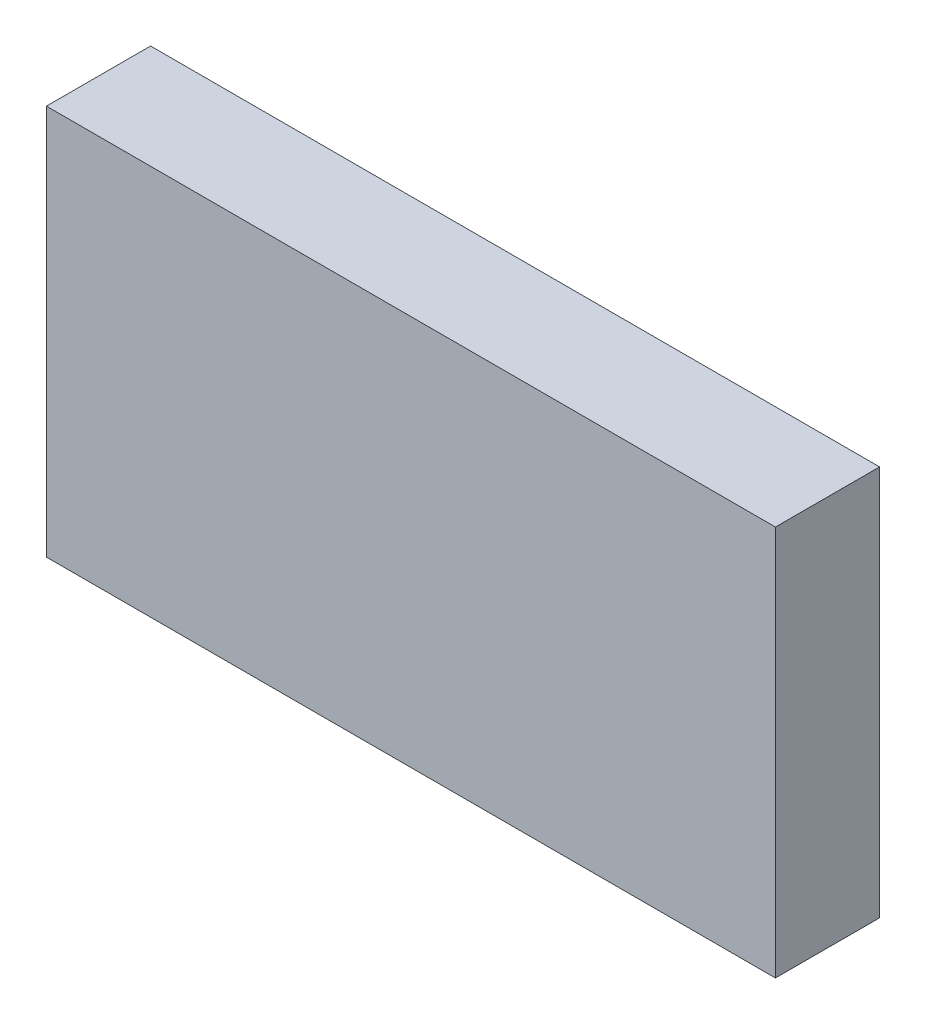
ISO-10303-21;
HEADER;
FILE_DESCRIPTION(('STEP AP214'),'2;1');
FILE_NAME('part.step','',(''),(''),'','','');
FILE_SCHEMA(('AUTOMOTIVE_DESIGN { 1 0 10303 214 1 1 1 1 }'));
ENDSEC;
DATA;
#1=APPLICATION_CONTEXT('core data for automotive mechanical design processes');
#2=APPLICATION_PROTOCOL_DEFINITION('international standard','automotive_design',2000,#1);
#3=PRODUCT_CONTEXT('',#1,'mechanical');
#4=PRODUCT('Part','Part','',(#3));
#5=PRODUCT_RELATED_PRODUCT_CATEGORY('part','',(#4));
#6=PRODUCT_DEFINITION_FORMATION('','',#4);
#7=PRODUCT_DEFINITION_CONTEXT('part definition',#1,'design');
#8=PRODUCT_DEFINITION('design','',#6,#7);
#9=PRODUCT_DEFINITION_SHAPE('','',#8);
#10=(LENGTH_UNIT() NAMED_UNIT(*) SI_UNIT(.MILLI.,.METRE.));
#11=(NAMED_UNIT(*) PLANE_ANGLE_UNIT() SI_UNIT($,.RADIAN.));
#12=(NAMED_UNIT(*) SI_UNIT($,.STERADIAN.) SOLID_ANGLE_UNIT());
#13=UNCERTAINTY_MEASURE_WITH_UNIT(LENGTH_MEASURE(1.E-05),#10,'distance_accuracy_value','');
#14=(GEOMETRIC_REPRESENTATION_CONTEXT(3) GLOBAL_UNCERTAINTY_ASSIGNED_CONTEXT((#13)) GLOBAL_UNIT_ASSIGNED_CONTEXT((#10,
#11,#12)) REPRESENTATION_CONTEXT('',''));
#15=CARTESIAN_POINT('',(0.,0.,0.));
#16=DIRECTION('',(0.,0.,1.));
#17=DIRECTION('',(1.,0.,0.));
#18=AXIS2_PLACEMENT_3D('',#15,#16,#17);
#19=CARTESIAN_POINT('',(-0.591343297244659,-0.649602719280402,0.0826433070866142));
#20=DIRECTION('',(0.,0.,-1.));
#21=DIRECTION('',(0.,1.,0.));
#22=AXIS2_PLACEMENT_3D('',#19,#20,#21);
#23=PLANE('',#22);
#24=DIRECTION('',(0.,1.,0.));
#25=VECTOR('',#24,1.);
#26=CARTESIAN_POINT('',(-0.587815738189541,-0.649602719280402,0.0826433070866142));
#27=LINE('',#26,#25);
#28=CARTESIAN_POINT('',(-0.587815738189541,-0.609917679910324,0.0826433070866142));
#29=VERTEX_POINT('',#28);
#30=CARTESIAN_POINT('',(-0.587815738189541,-0.647712955500875,0.0826433070866142));
#31=VERTEX_POINT('',#30);
#32=EDGE_CURVE('E71',#29,#31,#27,.F.);
#33=ORIENTED_EDGE('',*,*,#32,.T.);
#34=DIRECTION('',(1.,0.,0.));
#35=VECTOR('',#34,1.);
#36=CARTESIAN_POINT('',(-0.513736998032061,-0.647712955500875,0.0826433070866142));
#37=LINE('',#36,#35);
#38=CARTESIAN_POINT('',(-0.517264557087179,-0.647712955500875,0.0826433070866142));
#39=VERTEX_POINT('',#38);
#40=EDGE_CURVE('E54',#39,#31,#37,.F.);
#41=ORIENTED_EDGE('',*,*,#40,.F.);
#42=DIRECTION('',(0.,1.,0.));
#43=VECTOR('',#42,1.);
#44=CARTESIAN_POINT('',(-0.517264557087179,-0.649602719280402,0.0826433070866142));
#45=LINE('',#44,#43);
#46=CARTESIAN_POINT('',(-0.517264557087179,-0.609917679910324,0.0826433070866142));
#47=VERTEX_POINT('',#46);
#48=EDGE_CURVE('E20',#47,#39,#45,.F.);
#49=ORIENTED_EDGE('',*,*,#48,.F.);
#50=DIRECTION('',(1.,0.,0.));
#51=VECTOR('',#50,1.);
#52=CARTESIAN_POINT('',(-0.513736998032061,-0.609917679910324,0.0826433070866142));
#53=LINE('',#52,#51);
#54=EDGE_CURVE('E81',#29,#47,#53,.T.);
#55=ORIENTED_EDGE('',*,*,#54,.F.);
#56=EDGE_LOOP('',(#33,#41,#49,#55));
#57=FACE_BOUND('',#56,.T.);
#58=ADVANCED_FACE('F17',(#57),#23,.F.);
#59=CARTESIAN_POINT('',(-0.517264557087179,-0.649602719280402,0.0720606299212598));
#60=DIRECTION('',(-1.,0.,0.));
#61=DIRECTION('',(0.,0.,1.));
#62=AXIS2_PLACEMENT_3D('',#59,#60,#61);
#63=PLANE('',#62);
#64=DIRECTION('',(0.,0.,-1.));
#65=VECTOR('',#64,1.);
#66=CARTESIAN_POINT('',(-0.517264557087179,-0.609917679910324,0.0831472440944882));
#67=LINE('',#66,#65);
#68=CARTESIAN_POINT('',(-0.517264557087179,-0.609917679910324,0.0725645669291339));
#69=VERTEX_POINT('',#68);
#70=EDGE_CURVE('E64',#47,#69,#67,.T.);
#71=ORIENTED_EDGE('',*,*,#70,.F.);
#72=ORIENTED_EDGE('',*,*,#48,.T.);
#73=DIRECTION('',(0.,0.,1.));
#74=VECTOR('',#73,1.);
#75=CARTESIAN_POINT('',(-0.517264557087179,-0.647712955500875,0.0720606299212598));
#76=LINE('',#75,#74);
#77=CARTESIAN_POINT('',(-0.517264557087179,-0.647712955500875,0.0725645669291339));
#78=VERTEX_POINT('',#77);
#79=EDGE_CURVE('E62',#78,#39,#76,.T.);
#80=ORIENTED_EDGE('',*,*,#79,.F.);
#81=DIRECTION('',(0.,-1.,0.));
#82=VECTOR('',#81,1.);
#83=CARTESIAN_POINT('',(-0.517264557087179,-0.649602719280402,0.0725645669291339));
#84=LINE('',#83,#82);
#85=EDGE_CURVE('E83',#69,#78,#84,.T.);
#86=ORIENTED_EDGE('',*,*,#85,.F.);
#87=EDGE_LOOP('',(#71,#72,#80,#86));
#88=FACE_BOUND('',#87,.T.);
#89=ADVANCED_FACE('F60',(#88),#63,.F.);
#90=CARTESIAN_POINT('',(-0.513736998032061,-0.647712955500875,0.0720606299212598));
#91=DIRECTION('',(0.,1.,0.));
#92=DIRECTION('',(0.,0.,1.));
#93=AXIS2_PLACEMENT_3D('',#90,#91,#92);
#94=PLANE('',#93);
#95=DIRECTION('',(0.,0.,1.));
#96=VECTOR('',#95,1.);
#97=CARTESIAN_POINT('',(-0.587815738189541,-0.647712955500875,0.0720606299212598));
#98=LINE('',#97,#96);
#99=CARTESIAN_POINT('',(-0.587815738189541,-0.647712955500875,0.0725645669291339));
#100=VERTEX_POINT('',#99);
#101=EDGE_CURVE('E73',#31,#100,#98,.F.);
#102=ORIENTED_EDGE('',*,*,#101,.T.);
#103=DIRECTION('',(1.,0.,0.));
#104=VECTOR('',#103,1.);
#105=CARTESIAN_POINT('',(-0.513736998032061,-0.647712955500875,0.0725645669291339));
#106=LINE('',#105,#104);
#107=EDGE_CURVE('E69',#78,#100,#106,.F.);
#108=ORIENTED_EDGE('',*,*,#107,.F.);
#109=ORIENTED_EDGE('',*,*,#79,.T.);
#110=ORIENTED_EDGE('',*,*,#40,.T.);
#111=EDGE_LOOP('',(#102,#108,#109,#110));
#112=FACE_BOUND('',#111,.T.);
#113=ADVANCED_FACE('F68',(#112),#94,.F.);
#114=CARTESIAN_POINT('',(-0.587815738189541,-0.649602719280402,0.0720606299212598));
#115=DIRECTION('',(-1.,0.,0.));
#116=DIRECTION('',(0.,0.,1.));
#117=AXIS2_PLACEMENT_3D('',#114,#115,#116);
#118=PLANE('',#117);
#119=ORIENTED_EDGE('',*,*,#32,.F.);
#120=DIRECTION('',(0.,0.,-1.));
#121=VECTOR('',#120,1.);
#122=CARTESIAN_POINT('',(-0.587815738189541,-0.609917679910324,0.0831472440944882));
#123=LINE('',#122,#121);
#124=CARTESIAN_POINT('',(-0.587815738189541,-0.609917679910324,0.0725645669291339));
#125=VERTEX_POINT('',#124);
#126=EDGE_CURVE('E78',#125,#29,#123,.F.);
#127=ORIENTED_EDGE('',*,*,#126,.F.);
#128=DIRECTION('',(0.,-1.,0.));
#129=VECTOR('',#128,1.);
#130=CARTESIAN_POINT('',(-0.587815738189541,-0.649602719280402,0.0725645669291339));
#131=LINE('',#130,#129);
#132=EDGE_CURVE('E26',#100,#125,#131,.F.);
#133=ORIENTED_EDGE('',*,*,#132,.F.);
#134=ORIENTED_EDGE('',*,*,#101,.F.);
#135=EDGE_LOOP('',(#119,#127,#133,#134));
#136=FACE_BOUND('',#135,.T.);
#137=ADVANCED_FACE('F88',(#136),#118,.T.);
#138=CARTESIAN_POINT('',(-0.513736998032061,-0.609917679910324,0.0831472440944882));
#139=DIRECTION('',(0.,-1.,0.));
#140=DIRECTION('',(0.,0.,-1.));
#141=AXIS2_PLACEMENT_3D('',#138,#139,#140);
#142=PLANE('',#141);
#143=ORIENTED_EDGE('',*,*,#126,.T.);
#144=ORIENTED_EDGE('',*,*,#54,.T.);
#145=ORIENTED_EDGE('',*,*,#70,.T.);
#146=DIRECTION('',(1.,0.,0.));
#147=VECTOR('',#146,1.);
#148=CARTESIAN_POINT('',(-0.513736998032061,-0.609917679910324,0.0725645669291339));
#149=LINE('',#148,#147);
#150=EDGE_CURVE('E11',#125,#69,#149,.T.);
#151=ORIENTED_EDGE('',*,*,#150,.F.);
#152=EDGE_LOOP('',(#143,#144,#145,#151));
#153=FACE_BOUND('',#152,.T.);
#154=ADVANCED_FACE('F91',(#153),#142,.F.);
#155=CARTESIAN_POINT('',(-0.513736998032061,-0.649602719280402,0.0725645669291339));
#156=DIRECTION('',(0.,0.,1.));
#157=DIRECTION('',(0.,-1.,0.));
#158=AXIS2_PLACEMENT_3D('',#155,#156,#157);
#159=PLANE('',#158);
#160=ORIENTED_EDGE('',*,*,#132,.T.);
#161=ORIENTED_EDGE('',*,*,#150,.T.);
#162=ORIENTED_EDGE('',*,*,#85,.T.);
#163=ORIENTED_EDGE('',*,*,#107,.T.);
#164=EDGE_LOOP('',(#160,#161,#162,#163));
#165=FACE_BOUND('',#164,.T.);
#166=ADVANCED_FACE('F86',(#165),#159,.F.);
#167=CLOSED_SHELL('',(#58,#89,#113,#137,#154,#166));
#168=MANIFOLD_SOLID_BREP('B1',#167);
#169=ADVANCED_BREP_SHAPE_REPRESENTATION('',(#18,#168),#14);
#170=SHAPE_DEFINITION_REPRESENTATION(#9,#169);
ENDSEC;
END-ISO-10303-21;
